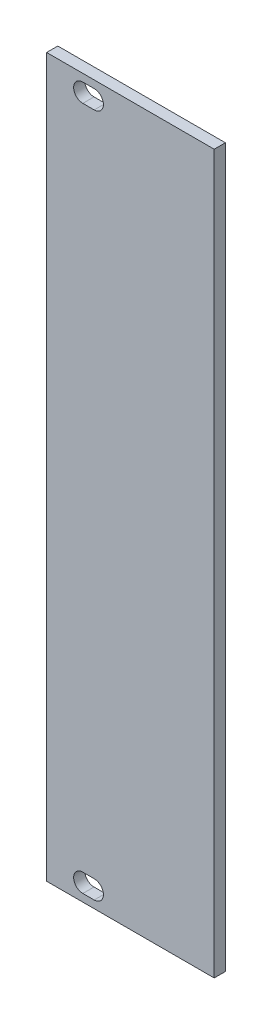
ISO-10303-21;
HEADER;
FILE_DESCRIPTION(('STEP AP214'),'2;1');
FILE_NAME('part.step','',(''),(''),'','','');
FILE_SCHEMA(('AUTOMOTIVE_DESIGN { 1 0 10303 214 1 1 1 1 }'));
ENDSEC;
DATA;
#1=APPLICATION_CONTEXT('core data for automotive mechanical design processes');
#2=APPLICATION_PROTOCOL_DEFINITION('international standard','automotive_design',2000,#1);
#3=PRODUCT_CONTEXT('',#1,'mechanical');
#4=PRODUCT('Part','Part','',(#3));
#5=PRODUCT_RELATED_PRODUCT_CATEGORY('part','',(#4));
#6=PRODUCT_DEFINITION_FORMATION('','',#4);
#7=PRODUCT_DEFINITION_CONTEXT('part definition',#1,'design');
#8=PRODUCT_DEFINITION('design','',#6,#7);
#9=PRODUCT_DEFINITION_SHAPE('','',#8);
#10=(LENGTH_UNIT() NAMED_UNIT(*) SI_UNIT(.MILLI.,.METRE.));
#11=(NAMED_UNIT(*) PLANE_ANGLE_UNIT() SI_UNIT($,.RADIAN.));
#12=(NAMED_UNIT(*) SI_UNIT($,.STERADIAN.) SOLID_ANGLE_UNIT());
#13=UNCERTAINTY_MEASURE_WITH_UNIT(LENGTH_MEASURE(1.E-05),#10,'distance_accuracy_value','');
#14=(GEOMETRIC_REPRESENTATION_CONTEXT(3) GLOBAL_UNCERTAINTY_ASSIGNED_CONTEXT((#13)) GLOBAL_UNIT_ASSIGNED_CONTEXT((#10,
#11,#12)) REPRESENTATION_CONTEXT('',''));
#15=CARTESIAN_POINT('',(0.,0.,0.));
#16=DIRECTION('',(0.,0.,1.));
#17=DIRECTION('',(1.,0.,0.));
#18=AXIS2_PLACEMENT_3D('',#15,#16,#17);
#19=CARTESIAN_POINT('',(0.,0.,2.));
#20=DIRECTION('',(0.,0.,1.));
#21=DIRECTION('',(1.,0.,0.));
#22=AXIS2_PLACEMENT_3D('',#19,#20,#21);
#23=PLANE('',#22);
#24=DIRECTION('',(0.,1.,0.));
#25=VECTOR('',#24,1.);
#26=CARTESIAN_POINT('',(15.,64.25,2.));
#27=LINE('',#26,#25);
#28=CARTESIAN_POINT('',(15.,-64.25,2.));
#29=VERTEX_POINT('',#28);
#30=CARTESIAN_POINT('',(15.,64.25,2.));
#31=VERTEX_POINT('',#30);
#32=EDGE_CURVE('E226',#29,#31,#27,.T.);
#33=ORIENTED_EDGE('',*,*,#32,.T.);
#34=DIRECTION('',(-1.,0.,0.));
#35=VECTOR('',#34,1.);
#36=CARTESIAN_POINT('',(-15.,64.25,2.));
#37=LINE('',#36,#35);
#38=CARTESIAN_POINT('',(-15.,64.25,2.));
#39=VERTEX_POINT('',#38);
#40=EDGE_CURVE('E230',#31,#39,#37,.T.);
#41=ORIENTED_EDGE('',*,*,#40,.T.);
#42=DIRECTION('',(0.,-1.,0.));
#43=VECTOR('',#42,1.);
#44=CARTESIAN_POINT('',(-15.,64.25,2.));
#45=LINE('',#44,#43);
#46=CARTESIAN_POINT('',(-15.,-64.25,2.));
#47=VERTEX_POINT('',#46);
#48=EDGE_CURVE('E234',#39,#47,#45,.T.);
#49=ORIENTED_EDGE('',*,*,#48,.T.);
#50=DIRECTION('',(1.,0.,0.));
#51=VECTOR('',#50,1.);
#52=CARTESIAN_POINT('',(-15.,-64.25,2.));
#53=LINE('',#52,#51);
#54=EDGE_CURVE('E237',#47,#29,#53,.T.);
#55=ORIENTED_EDGE('',*,*,#54,.T.);
#56=EDGE_LOOP('',(#33,#41,#49,#55));
#57=FACE_BOUND('',#56,.T.);
#58=DIRECTION('',(1.,0.,0.));
#59=VECTOR('',#58,1.);
#60=CARTESIAN_POINT('',(-8.51599999999999,-62.9,2.));
#61=LINE('',#60,#59);
#62=CARTESIAN_POINT('',(-8.51599999999999,-62.9,2.));
#63=VERTEX_POINT('',#62);
#64=CARTESIAN_POINT('',(-6.48399999999999,-62.9,2.));
#65=VERTEX_POINT('',#64);
#66=EDGE_CURVE('E186',#63,#65,#61,.T.);
#67=ORIENTED_EDGE('',*,*,#66,.F.);
#68=CARTESIAN_POINT('',(-8.51599999999999,-61.25,2.));
#69=DIRECTION('',(0.,0.,1.));
#70=DIRECTION('',(1.,0.,0.));
#71=AXIS2_PLACEMENT_3D('',#68,#69,#70);
#72=CIRCLE('',#71,1.65);
#73=CARTESIAN_POINT('',(-8.51599999999999,-59.6,2.));
#74=VERTEX_POINT('',#73);
#75=EDGE_CURVE('E183',#74,#63,#72,.T.);
#76=ORIENTED_EDGE('',*,*,#75,.F.);
#77=DIRECTION('',(-1.,0.,0.));
#78=VECTOR('',#77,1.);
#79=CARTESIAN_POINT('',(-8.51599999999999,-59.6,2.));
#80=LINE('',#79,#78);
#81=CARTESIAN_POINT('',(-6.48399999999999,-59.6,2.));
#82=VERTEX_POINT('',#81);
#83=EDGE_CURVE('E194',#82,#74,#80,.T.);
#84=ORIENTED_EDGE('',*,*,#83,.F.);
#85=CARTESIAN_POINT('',(-6.48399999999999,-61.25,2.));
#86=DIRECTION('',(0.,0.,1.));
#87=DIRECTION('',(1.,0.,0.));
#88=AXIS2_PLACEMENT_3D('',#85,#86,#87);
#89=CIRCLE('',#88,1.65000000000001);
#90=EDGE_CURVE('E190',#65,#82,#89,.T.);
#91=ORIENTED_EDGE('',*,*,#90,.F.);
#92=EDGE_LOOP('',(#67,#76,#84,#91));
#93=FACE_BOUND('',#92,.T.);
#94=DIRECTION('',(1.,0.,0.));
#95=VECTOR('',#94,1.);
#96=CARTESIAN_POINT('',(-8.51600000000001,59.6,2.));
#97=LINE('',#96,#95);
#98=CARTESIAN_POINT('',(-8.51600000000001,59.6,2.));
#99=VERTEX_POINT('',#98);
#100=CARTESIAN_POINT('',(-6.484,59.6,2.));
#101=VERTEX_POINT('',#100);
#102=EDGE_CURVE('E144',#99,#101,#97,.T.);
#103=ORIENTED_EDGE('',*,*,#102,.F.);
#104=CARTESIAN_POINT('',(-8.51600000000001,61.25,2.));
#105=DIRECTION('',(0.,0.,1.));
#106=DIRECTION('',(1.,0.,0.));
#107=AXIS2_PLACEMENT_3D('',#104,#105,#106);
#108=CIRCLE('',#107,1.65);
#109=CARTESIAN_POINT('',(-8.51600000000001,62.9,2.));
#110=VERTEX_POINT('',#109);
#111=EDGE_CURVE('E135',#110,#99,#108,.T.);
#112=ORIENTED_EDGE('',*,*,#111,.F.);
#113=DIRECTION('',(-1.,0.,0.));
#114=VECTOR('',#113,1.);
#115=CARTESIAN_POINT('',(-8.51600000000001,62.9,2.));
#116=LINE('',#115,#114);
#117=CARTESIAN_POINT('',(-6.484,62.9,2.));
#118=VERTEX_POINT('',#117);
#119=EDGE_CURVE('E161',#118,#110,#116,.T.);
#120=ORIENTED_EDGE('',*,*,#119,.F.);
#121=CARTESIAN_POINT('',(-6.484,61.25,2.));
#122=DIRECTION('',(0.,0.,1.));
#123=DIRECTION('',(1.,0.,0.));
#124=AXIS2_PLACEMENT_3D('',#121,#122,#123);
#125=CIRCLE('',#124,1.65);
#126=EDGE_CURVE('E157',#101,#118,#125,.T.);
#127=ORIENTED_EDGE('',*,*,#126,.F.);
#128=EDGE_LOOP('',(#103,#112,#120,#127));
#129=FACE_BOUND('',#128,.T.);
#130=ADVANCED_FACE('F45',(#57,#93,#129),#23,.T.);
#131=CARTESIAN_POINT('',(0.,0.,0.));
#132=DIRECTION('',(0.,0.,1.));
#133=DIRECTION('',(1.,0.,0.));
#134=AXIS2_PLACEMENT_3D('',#131,#132,#133);
#135=PLANE('',#134);
#136=CARTESIAN_POINT('',(-8.51599999999999,-61.25,0.));
#137=DIRECTION('',(0.,0.,1.));
#138=DIRECTION('',(1.,0.,0.));
#139=AXIS2_PLACEMENT_3D('',#136,#137,#138);
#140=CIRCLE('',#139,1.65);
#141=CARTESIAN_POINT('',(-8.51599999999999,-59.6,0.));
#142=VERTEX_POINT('',#141);
#143=CARTESIAN_POINT('',(-8.51599999999999,-62.9,0.));
#144=VERTEX_POINT('',#143);
#145=EDGE_CURVE('E153',#142,#144,#140,.T.);
#146=ORIENTED_EDGE('',*,*,#145,.T.);
#147=DIRECTION('',(1.,0.,0.));
#148=VECTOR('',#147,1.);
#149=CARTESIAN_POINT('',(-8.51599999999999,-62.9,0.));
#150=LINE('',#149,#148);
#151=CARTESIAN_POINT('',(-6.48399999999999,-62.9,0.));
#152=VERTEX_POINT('',#151);
#153=EDGE_CURVE('E201',#144,#152,#150,.T.);
#154=ORIENTED_EDGE('',*,*,#153,.T.);
#155=CARTESIAN_POINT('',(-6.48399999999999,-61.25,0.));
#156=DIRECTION('',(0.,0.,1.));
#157=DIRECTION('',(1.,0.,0.));
#158=AXIS2_PLACEMENT_3D('',#155,#156,#157);
#159=CIRCLE('',#158,1.65000000000001);
#160=CARTESIAN_POINT('',(-6.48399999999999,-59.6,0.));
#161=VERTEX_POINT('',#160);
#162=EDGE_CURVE('E205',#152,#161,#159,.T.);
#163=ORIENTED_EDGE('',*,*,#162,.T.);
#164=DIRECTION('',(-1.,0.,0.));
#165=VECTOR('',#164,1.);
#166=CARTESIAN_POINT('',(-8.51599999999999,-59.6,0.));
#167=LINE('',#166,#165);
#168=EDGE_CURVE('E187',#161,#142,#167,.T.);
#169=ORIENTED_EDGE('',*,*,#168,.T.);
#170=EDGE_LOOP('',(#146,#154,#163,#169));
#171=FACE_BOUND('',#170,.T.);
#172=DIRECTION('',(0.,1.,0.));
#173=VECTOR('',#172,1.);
#174=CARTESIAN_POINT('',(15.,64.25,0.));
#175=LINE('',#174,#173);
#176=CARTESIAN_POINT('',(15.,-64.25,0.));
#177=VERTEX_POINT('',#176);
#178=CARTESIAN_POINT('',(15.,64.25,0.));
#179=VERTEX_POINT('',#178);
#180=EDGE_CURVE('E225',#177,#179,#175,.T.);
#181=ORIENTED_EDGE('',*,*,#180,.F.);
#182=DIRECTION('',(1.,0.,0.));
#183=VECTOR('',#182,1.);
#184=CARTESIAN_POINT('',(-15.,-64.25,0.));
#185=LINE('',#184,#183);
#186=CARTESIAN_POINT('',(-15.,-64.25,0.));
#187=VERTEX_POINT('',#186);
#188=EDGE_CURVE('E231',#187,#177,#185,.T.);
#189=ORIENTED_EDGE('',*,*,#188,.F.);
#190=DIRECTION('',(0.,-1.,0.));
#191=VECTOR('',#190,1.);
#192=CARTESIAN_POINT('',(-15.,64.25,0.));
#193=LINE('',#192,#191);
#194=CARTESIAN_POINT('',(-15.,64.25,0.));
#195=VERTEX_POINT('',#194);
#196=EDGE_CURVE('E247',#195,#187,#193,.T.);
#197=ORIENTED_EDGE('',*,*,#196,.F.);
#198=DIRECTION('',(-1.,0.,0.));
#199=VECTOR('',#198,1.);
#200=CARTESIAN_POINT('',(-15.,64.25,0.));
#201=LINE('',#200,#199);
#202=EDGE_CURVE('E244',#179,#195,#201,.T.);
#203=ORIENTED_EDGE('',*,*,#202,.F.);
#204=EDGE_LOOP('',(#181,#189,#197,#203));
#205=FACE_BOUND('',#204,.T.);
#206=CARTESIAN_POINT('',(-8.51600000000001,61.25,0.));
#207=DIRECTION('',(0.,0.,1.));
#208=DIRECTION('',(1.,0.,0.));
#209=AXIS2_PLACEMENT_3D('',#206,#207,#208);
#210=CIRCLE('',#209,1.65);
#211=CARTESIAN_POINT('',(-8.51600000000001,62.9,0.));
#212=VERTEX_POINT('',#211);
#213=CARTESIAN_POINT('',(-8.51600000000001,59.6,0.));
#214=VERTEX_POINT('',#213);
#215=EDGE_CURVE('E69',#212,#214,#210,.T.);
#216=ORIENTED_EDGE('',*,*,#215,.T.);
#217=DIRECTION('',(1.,0.,0.));
#218=VECTOR('',#217,1.);
#219=CARTESIAN_POINT('',(-8.51600000000001,59.6,0.));
#220=LINE('',#219,#218);
#221=CARTESIAN_POINT('',(-6.484,59.6,0.));
#222=VERTEX_POINT('',#221);
#223=EDGE_CURVE('E151',#214,#222,#220,.T.);
#224=ORIENTED_EDGE('',*,*,#223,.T.);
#225=CARTESIAN_POINT('',(-6.484,61.25,0.));
#226=DIRECTION('',(0.,0.,1.));
#227=DIRECTION('',(1.,0.,0.));
#228=AXIS2_PLACEMENT_3D('',#225,#226,#227);
#229=CIRCLE('',#228,1.65);
#230=CARTESIAN_POINT('',(-6.484,62.9,0.));
#231=VERTEX_POINT('',#230);
#232=EDGE_CURVE('E170',#222,#231,#229,.T.);
#233=ORIENTED_EDGE('',*,*,#232,.T.);
#234=DIRECTION('',(-1.,0.,0.));
#235=VECTOR('',#234,1.);
#236=CARTESIAN_POINT('',(-8.51600000000001,62.9,0.));
#237=LINE('',#236,#235);
#238=EDGE_CURVE('E145',#231,#212,#237,.T.);
#239=ORIENTED_EDGE('',*,*,#238,.T.);
#240=EDGE_LOOP('',(#216,#224,#233,#239));
#241=FACE_BOUND('',#240,.T.);
#242=ADVANCED_FACE('F270',(#171,#205,#241),#135,.F.);
#243=CARTESIAN_POINT('',(15.,64.25,2.));
#244=DIRECTION('',(-1.,0.,0.));
#245=DIRECTION('',(0.,-1.,0.));
#246=AXIS2_PLACEMENT_3D('',#243,#244,#245);
#247=PLANE('',#246);
#248=ORIENTED_EDGE('',*,*,#180,.T.);
#249=DIRECTION('',(0.,0.,-1.));
#250=VECTOR('',#249,1.);
#251=CARTESIAN_POINT('',(15.,64.25,2.));
#252=LINE('',#251,#250);
#253=EDGE_CURVE('E11',#31,#179,#252,.T.);
#254=ORIENTED_EDGE('',*,*,#253,.F.);
#255=ORIENTED_EDGE('',*,*,#32,.F.);
#256=DIRECTION('',(0.,0.,-1.));
#257=VECTOR('',#256,1.);
#258=CARTESIAN_POINT('',(15.,-64.25,2.));
#259=LINE('',#258,#257);
#260=EDGE_CURVE('E240',#29,#177,#259,.T.);
#261=ORIENTED_EDGE('',*,*,#260,.T.);
#262=EDGE_LOOP('',(#248,#254,#255,#261));
#263=FACE_BOUND('',#262,.T.);
#264=ADVANCED_FACE('F47',(#263),#247,.F.);
#265=CARTESIAN_POINT('',(-15.,64.25,2.));
#266=DIRECTION('',(0.,-1.,0.));
#267=DIRECTION('',(0.,0.,-1.));
#268=AXIS2_PLACEMENT_3D('',#265,#266,#267);
#269=PLANE('',#268);
#270=ORIENTED_EDGE('',*,*,#202,.T.);
#271=DIRECTION('',(0.,0.,-1.));
#272=VECTOR('',#271,1.);
#273=CARTESIAN_POINT('',(-15.,64.25,2.));
#274=LINE('',#273,#272);
#275=EDGE_CURVE('E54',#39,#195,#274,.T.);
#276=ORIENTED_EDGE('',*,*,#275,.F.);
#277=ORIENTED_EDGE('',*,*,#40,.F.);
#278=ORIENTED_EDGE('',*,*,#253,.T.);
#279=EDGE_LOOP('',(#270,#276,#277,#278));
#280=FACE_BOUND('',#279,.T.);
#281=ADVANCED_FACE('F281',(#280),#269,.F.);
#282=CARTESIAN_POINT('',(-15.,64.25,2.));
#283=DIRECTION('',(1.,0.,0.));
#284=DIRECTION('',(0.,1.,0.));
#285=AXIS2_PLACEMENT_3D('',#282,#283,#284);
#286=PLANE('',#285);
#287=ORIENTED_EDGE('',*,*,#196,.T.);
#288=DIRECTION('',(0.,0.,-1.));
#289=VECTOR('',#288,1.);
#290=CARTESIAN_POINT('',(-15.,-64.25,2.));
#291=LINE('',#290,#289);
#292=EDGE_CURVE('E255',#47,#187,#291,.T.);
#293=ORIENTED_EDGE('',*,*,#292,.F.);
#294=ORIENTED_EDGE('',*,*,#48,.F.);
#295=ORIENTED_EDGE('',*,*,#275,.T.);
#296=EDGE_LOOP('',(#287,#293,#294,#295));
#297=FACE_BOUND('',#296,.T.);
#298=ADVANCED_FACE('F264',(#297),#286,.F.);
#299=CARTESIAN_POINT('',(-15.,-64.25,2.));
#300=DIRECTION('',(0.,1.,0.));
#301=DIRECTION('',(0.,0.,1.));
#302=AXIS2_PLACEMENT_3D('',#299,#300,#301);
#303=PLANE('',#302);
#304=ORIENTED_EDGE('',*,*,#188,.T.);
#305=ORIENTED_EDGE('',*,*,#260,.F.);
#306=ORIENTED_EDGE('',*,*,#54,.F.);
#307=ORIENTED_EDGE('',*,*,#292,.T.);
#308=EDGE_LOOP('',(#304,#305,#306,#307));
#309=FACE_BOUND('',#308,.T.);
#310=ADVANCED_FACE('F274',(#309),#303,.F.);
#311=CARTESIAN_POINT('',(-8.51599999999999,-61.25,2.));
#312=DIRECTION('',(0.,0.,-1.));
#313=DIRECTION('',(-1.,0.,0.));
#314=AXIS2_PLACEMENT_3D('',#311,#312,#313);
#315=CYLINDRICAL_SURFACE('',#314,1.65);
#316=ORIENTED_EDGE('',*,*,#145,.F.);
#317=DIRECTION('',(0.,0.,-1.));
#318=VECTOR('',#317,1.);
#319=CARTESIAN_POINT('',(-8.51599999999999,-59.6,2.));
#320=LINE('',#319,#318);
#321=EDGE_CURVE('E197',#74,#142,#320,.T.);
#322=ORIENTED_EDGE('',*,*,#321,.F.);
#323=ORIENTED_EDGE('',*,*,#75,.T.);
#324=DIRECTION('',(0.,0.,-1.));
#325=VECTOR('',#324,1.);
#326=CARTESIAN_POINT('',(-8.51599999999999,-62.9,2.));
#327=LINE('',#326,#325);
#328=EDGE_CURVE('E221',#63,#144,#327,.T.);
#329=ORIENTED_EDGE('',*,*,#328,.T.);
#330=EDGE_LOOP('',(#316,#322,#323,#329));
#331=FACE_BOUND('',#330,.T.);
#332=ADVANCED_FACE('F296',(#331),#315,.F.);
#333=CARTESIAN_POINT('',(-8.51599999999999,-62.9,2.));
#334=DIRECTION('',(0.,1.,0.));
#335=DIRECTION('',(-1.,0.,0.));
#336=AXIS2_PLACEMENT_3D('',#333,#334,#335);
#337=PLANE('',#336);
#338=ORIENTED_EDGE('',*,*,#153,.F.);
#339=ORIENTED_EDGE('',*,*,#328,.F.);
#340=ORIENTED_EDGE('',*,*,#66,.T.);
#341=DIRECTION('',(0.,0.,-1.));
#342=VECTOR('',#341,1.);
#343=CARTESIAN_POINT('',(-6.48399999999999,-62.9,2.));
#344=LINE('',#343,#342);
#345=EDGE_CURVE('E218',#65,#152,#344,.T.);
#346=ORIENTED_EDGE('',*,*,#345,.T.);
#347=EDGE_LOOP('',(#338,#339,#340,#346));
#348=FACE_BOUND('',#347,.T.);
#349=ADVANCED_FACE('F303',(#348),#337,.T.);
#350=CARTESIAN_POINT('',(-6.48399999999999,-61.25,2.));
#351=DIRECTION('',(0.,0.,-1.));
#352=DIRECTION('',(-1.,0.,0.));
#353=AXIS2_PLACEMENT_3D('',#350,#351,#352);
#354=CYLINDRICAL_SURFACE('',#353,1.65000000000001);
#355=ORIENTED_EDGE('',*,*,#162,.F.);
#356=ORIENTED_EDGE('',*,*,#345,.F.);
#357=ORIENTED_EDGE('',*,*,#90,.T.);
#358=DIRECTION('',(0.,0.,-1.));
#359=VECTOR('',#358,1.);
#360=CARTESIAN_POINT('',(-6.48399999999999,-59.6,2.));
#361=LINE('',#360,#359);
#362=EDGE_CURVE('E215',#82,#161,#361,.T.);
#363=ORIENTED_EDGE('',*,*,#362,.T.);
#364=EDGE_LOOP('',(#355,#356,#357,#363));
#365=FACE_BOUND('',#364,.T.);
#366=ADVANCED_FACE('F308',(#365),#354,.F.);
#367=CARTESIAN_POINT('',(-8.51599999999999,-59.6,2.));
#368=DIRECTION('',(0.,-1.,0.));
#369=DIRECTION('',(0.,0.,-1.));
#370=AXIS2_PLACEMENT_3D('',#367,#368,#369);
#371=PLANE('',#370);
#372=ORIENTED_EDGE('',*,*,#168,.F.);
#373=ORIENTED_EDGE('',*,*,#362,.F.);
#374=ORIENTED_EDGE('',*,*,#83,.T.);
#375=ORIENTED_EDGE('',*,*,#321,.T.);
#376=EDGE_LOOP('',(#372,#373,#374,#375));
#377=FACE_BOUND('',#376,.T.);
#378=ADVANCED_FACE('F315',(#377),#371,.T.);
#379=CARTESIAN_POINT('',(-8.51600000000001,61.25,2.));
#380=DIRECTION('',(0.,0.,-1.));
#381=DIRECTION('',(-1.,0.,0.));
#382=AXIS2_PLACEMENT_3D('',#379,#380,#381);
#383=CYLINDRICAL_SURFACE('',#382,1.65);
#384=ORIENTED_EDGE('',*,*,#215,.F.);
#385=DIRECTION('',(0.,0.,-1.));
#386=VECTOR('',#385,1.);
#387=CARTESIAN_POINT('',(-8.51600000000001,62.9,2.));
#388=LINE('',#387,#386);
#389=EDGE_CURVE('E139',#110,#212,#388,.T.);
#390=ORIENTED_EDGE('',*,*,#389,.F.);
#391=ORIENTED_EDGE('',*,*,#111,.T.);
#392=DIRECTION('',(0.,0.,-1.));
#393=VECTOR('',#392,1.);
#394=CARTESIAN_POINT('',(-8.51600000000001,59.6,2.));
#395=LINE('',#394,#393);
#396=EDGE_CURVE('E138',#99,#214,#395,.T.);
#397=ORIENTED_EDGE('',*,*,#396,.T.);
#398=EDGE_LOOP('',(#384,#390,#391,#397));
#399=FACE_BOUND('',#398,.T.);
#400=ADVANCED_FACE('F137',(#399),#383,.F.);
#401=CARTESIAN_POINT('',(-8.51600000000001,59.6,2.));
#402=DIRECTION('',(0.,1.,0.));
#403=DIRECTION('',(0.,0.,1.));
#404=AXIS2_PLACEMENT_3D('',#401,#402,#403);
#405=PLANE('',#404);
#406=ORIENTED_EDGE('',*,*,#223,.F.);
#407=ORIENTED_EDGE('',*,*,#396,.F.);
#408=ORIENTED_EDGE('',*,*,#102,.T.);
#409=DIRECTION('',(0.,0.,-1.));
#410=VECTOR('',#409,1.);
#411=CARTESIAN_POINT('',(-6.484,59.6,2.));
#412=LINE('',#411,#410);
#413=EDGE_CURVE('E154',#101,#222,#412,.T.);
#414=ORIENTED_EDGE('',*,*,#413,.T.);
#415=EDGE_LOOP('',(#406,#407,#408,#414));
#416=FACE_BOUND('',#415,.T.);
#417=ADVANCED_FACE('F148',(#416),#405,.T.);
#418=CARTESIAN_POINT('',(-6.484,61.25,2.));
#419=DIRECTION('',(0.,0.,-1.));
#420=DIRECTION('',(-1.,0.,0.));
#421=AXIS2_PLACEMENT_3D('',#418,#419,#420);
#422=CYLINDRICAL_SURFACE('',#421,1.65);
#423=ORIENTED_EDGE('',*,*,#232,.F.);
#424=ORIENTED_EDGE('',*,*,#413,.F.);
#425=ORIENTED_EDGE('',*,*,#126,.T.);
#426=DIRECTION('',(0.,0.,-1.));
#427=VECTOR('',#426,1.);
#428=CARTESIAN_POINT('',(-6.484,62.9,2.));
#429=LINE('',#428,#427);
#430=EDGE_CURVE('E61',#118,#231,#429,.T.);
#431=ORIENTED_EDGE('',*,*,#430,.T.);
#432=EDGE_LOOP('',(#423,#424,#425,#431));
#433=FACE_BOUND('',#432,.T.);
#434=ADVANCED_FACE('F333',(#433),#422,.F.);
#435=CARTESIAN_POINT('',(-8.51600000000001,62.9,2.));
#436=DIRECTION('',(0.,-1.,0.));
#437=DIRECTION('',(0.,0.,-1.));
#438=AXIS2_PLACEMENT_3D('',#435,#436,#437);
#439=PLANE('',#438);
#440=ORIENTED_EDGE('',*,*,#238,.F.);
#441=ORIENTED_EDGE('',*,*,#430,.F.);
#442=ORIENTED_EDGE('',*,*,#119,.T.);
#443=ORIENTED_EDGE('',*,*,#389,.T.);
#444=EDGE_LOOP('',(#440,#441,#442,#443));
#445=FACE_BOUND('',#444,.T.);
#446=ADVANCED_FACE('F336',(#445),#439,.T.);
#447=CLOSED_SHELL('',(#130,#242,#264,#281,#298,#310,#332,#349,#366,#378,#400,#417,#434,#446));
#448=MANIFOLD_SOLID_BREP('B2',#447);
#449=ADVANCED_BREP_SHAPE_REPRESENTATION('',(#18,#448),#14);
#450=SHAPE_DEFINITION_REPRESENTATION(#9,#449);
ENDSEC;
END-ISO-10303-21;
